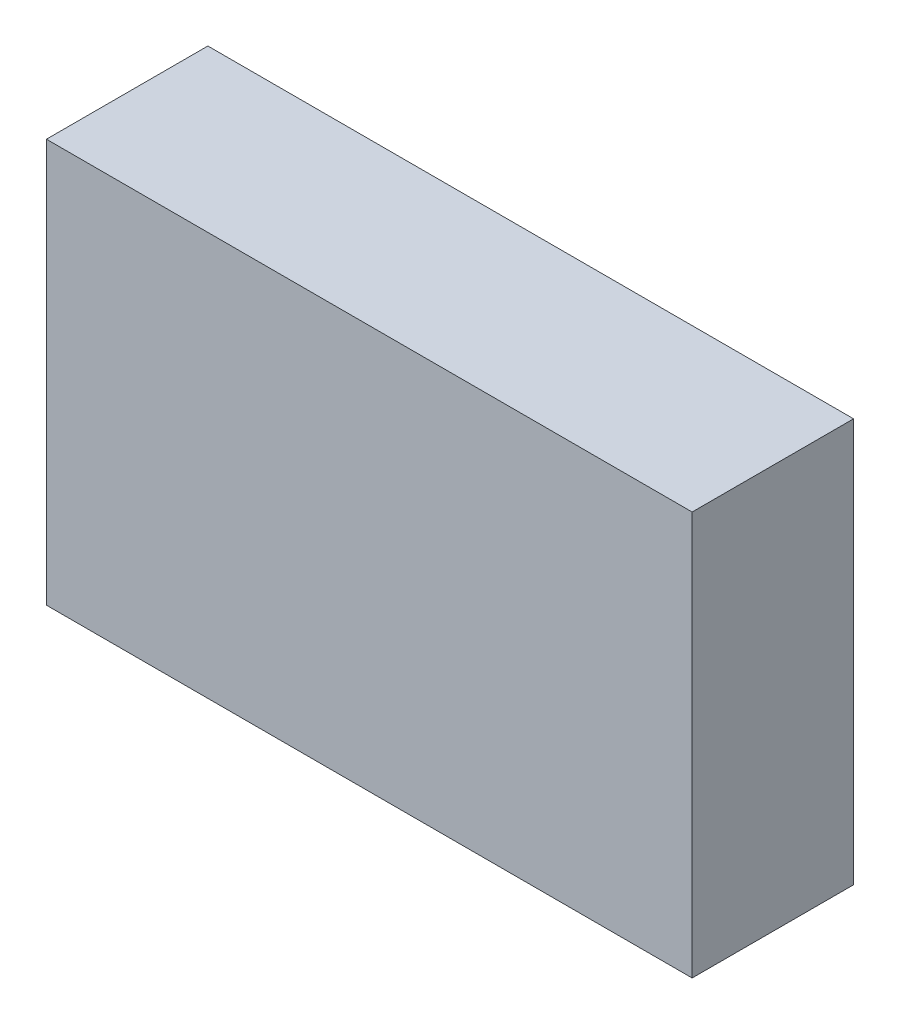
ISO-10303-21;
HEADER;
FILE_DESCRIPTION(('STEP AP214'),'2;1');
FILE_NAME('part.step','',(''),(''),'','','');
FILE_SCHEMA(('AUTOMOTIVE_DESIGN { 1 0 10303 214 1 1 1 1 }'));
ENDSEC;
DATA;
#1=APPLICATION_CONTEXT('core data for automotive mechanical design processes');
#2=APPLICATION_PROTOCOL_DEFINITION('international standard','automotive_design',2000,#1);
#3=PRODUCT_CONTEXT('',#1,'mechanical');
#4=PRODUCT('Part','Part','',(#3));
#5=PRODUCT_RELATED_PRODUCT_CATEGORY('part','',(#4));
#6=PRODUCT_DEFINITION_FORMATION('','',#4);
#7=PRODUCT_DEFINITION_CONTEXT('part definition',#1,'design');
#8=PRODUCT_DEFINITION('design','',#6,#7);
#9=PRODUCT_DEFINITION_SHAPE('','',#8);
#10=(LENGTH_UNIT() NAMED_UNIT(*) SI_UNIT(.MILLI.,.METRE.));
#11=(NAMED_UNIT(*) PLANE_ANGLE_UNIT() SI_UNIT($,.RADIAN.));
#12=(NAMED_UNIT(*) SI_UNIT($,.STERADIAN.) SOLID_ANGLE_UNIT());
#13=UNCERTAINTY_MEASURE_WITH_UNIT(LENGTH_MEASURE(1.E-05),#10,'distance_accuracy_value','');
#14=(GEOMETRIC_REPRESENTATION_CONTEXT(3) GLOBAL_UNCERTAINTY_ASSIGNED_CONTEXT((#13)) GLOBAL_UNIT_ASSIGNED_CONTEXT((#10,
#11,#12)) REPRESENTATION_CONTEXT('',''));
#15=CARTESIAN_POINT('',(0.,0.,0.));
#16=DIRECTION('',(0.,0.,1.));
#17=DIRECTION('',(1.,0.,0.));
#18=AXIS2_PLACEMENT_3D('',#15,#16,#17);
#19=CARTESIAN_POINT('',(-37.0093457943925,20.8411214953271,20.));
#20=DIRECTION('',(1.,0.,0.));
#21=DIRECTION('',(0.,1.,0.));
#22=AXIS2_PLACEMENT_3D('',#19,#20,#21);
#23=PLANE('',#22);
#24=DIRECTION('',(0.,-1.,0.));
#25=VECTOR('',#24,1.);
#26=CARTESIAN_POINT('',(-37.0093457943925,20.8411214953271,0.));
#27=LINE('',#26,#25);
#28=CARTESIAN_POINT('',(-37.0093457943925,20.8411214953271,0.));
#29=VERTEX_POINT('',#28);
#30=CARTESIAN_POINT('',(-37.0093457943925,-29.1588785046729,0.));
#31=VERTEX_POINT('',#30);
#32=EDGE_CURVE('E104',#29,#31,#27,.T.);
#33=ORIENTED_EDGE('',*,*,#32,.T.);
#34=DIRECTION('',(0.,0.,-1.));
#35=VECTOR('',#34,1.);
#36=CARTESIAN_POINT('',(-37.0093457943925,-29.1588785046729,20.));
#37=LINE('',#36,#35);
#38=CARTESIAN_POINT('',(-37.0093457943925,-29.1588785046729,20.));
#39=VERTEX_POINT('',#38);
#40=EDGE_CURVE('E11',#39,#31,#37,.T.);
#41=ORIENTED_EDGE('',*,*,#40,.F.);
#42=DIRECTION('',(0.,-1.,0.));
#43=VECTOR('',#42,1.);
#44=CARTESIAN_POINT('',(-37.0093457943925,20.8411214953271,20.));
#45=LINE('',#44,#43);
#46=CARTESIAN_POINT('',(-37.0093457943925,20.8411214953271,20.));
#47=VERTEX_POINT('',#46);
#48=EDGE_CURVE('E92',#47,#39,#45,.T.);
#49=ORIENTED_EDGE('',*,*,#48,.F.);
#50=DIRECTION('',(0.,0.,-1.));
#51=VECTOR('',#50,1.);
#52=CARTESIAN_POINT('',(-37.0093457943925,20.8411214953271,20.));
#53=LINE('',#52,#51);
#54=EDGE_CURVE('E100',#47,#29,#53,.T.);
#55=ORIENTED_EDGE('',*,*,#54,.T.);
#56=EDGE_LOOP('',(#33,#41,#49,#55));
#57=FACE_BOUND('',#56,.T.);
#58=ADVANCED_FACE('F41',(#57),#23,.F.);
#59=CARTESIAN_POINT('',(-37.0093457943925,-29.1588785046729,20.));
#60=DIRECTION('',(0.,1.,0.));
#61=DIRECTION('',(0.,0.,1.));
#62=AXIS2_PLACEMENT_3D('',#59,#60,#61);
#63=PLANE('',#62);
#64=DIRECTION('',(1.,0.,0.));
#65=VECTOR('',#64,1.);
#66=CARTESIAN_POINT('',(-37.0093457943925,-29.1588785046729,0.));
#67=LINE('',#66,#65);
#68=CARTESIAN_POINT('',(42.9906542056075,-29.1588785046729,0.));
#69=VERTEX_POINT('',#68);
#70=EDGE_CURVE('E96',#31,#69,#67,.T.);
#71=ORIENTED_EDGE('',*,*,#70,.T.);
#72=DIRECTION('',(0.,0.,-1.));
#73=VECTOR('',#72,1.);
#74=CARTESIAN_POINT('',(42.9906542056075,-29.1588785046729,20.));
#75=LINE('',#74,#73);
#76=CARTESIAN_POINT('',(42.9906542056075,-29.1588785046729,20.));
#77=VERTEX_POINT('',#76);
#78=EDGE_CURVE('E49',#77,#69,#75,.T.);
#79=ORIENTED_EDGE('',*,*,#78,.F.);
#80=DIRECTION('',(1.,0.,0.));
#81=VECTOR('',#80,1.);
#82=CARTESIAN_POINT('',(-37.0093457943925,-29.1588785046729,20.));
#83=LINE('',#82,#81);
#84=EDGE_CURVE('E87',#39,#77,#83,.T.);
#85=ORIENTED_EDGE('',*,*,#84,.F.);
#86=ORIENTED_EDGE('',*,*,#40,.T.);
#87=EDGE_LOOP('',(#71,#79,#85,#86));
#88=FACE_BOUND('',#87,.T.);
#89=ADVANCED_FACE('F95',(#88),#63,.F.);
#90=CARTESIAN_POINT('',(42.9906542056075,20.8411214953271,20.));
#91=DIRECTION('',(-1.,0.,0.));
#92=DIRECTION('',(0.,0.,1.));
#93=AXIS2_PLACEMENT_3D('',#90,#91,#92);
#94=PLANE('',#93);
#95=DIRECTION('',(0.,1.,0.));
#96=VECTOR('',#95,1.);
#97=CARTESIAN_POINT('',(42.9906542056075,20.8411214953271,0.));
#98=LINE('',#97,#96);
#99=CARTESIAN_POINT('',(42.9906542056075,20.8411214953271,0.));
#100=VERTEX_POINT('',#99);
#101=EDGE_CURVE('E74',#69,#100,#98,.T.);
#102=ORIENTED_EDGE('',*,*,#101,.T.);
#103=DIRECTION('',(0.,0.,-1.));
#104=VECTOR('',#103,1.);
#105=CARTESIAN_POINT('',(42.9906542056075,20.8411214953271,20.));
#106=LINE('',#105,#104);
#107=CARTESIAN_POINT('',(42.9906542056075,20.8411214953271,20.));
#108=VERTEX_POINT('',#107);
#109=EDGE_CURVE('E97',#108,#100,#106,.T.);
#110=ORIENTED_EDGE('',*,*,#109,.F.);
#111=DIRECTION('',(0.,1.,0.));
#112=VECTOR('',#111,1.);
#113=CARTESIAN_POINT('',(42.9906542056075,20.8411214953271,20.));
#114=LINE('',#113,#112);
#115=EDGE_CURVE('E90',#77,#108,#114,.T.);
#116=ORIENTED_EDGE('',*,*,#115,.F.);
#117=ORIENTED_EDGE('',*,*,#78,.T.);
#118=EDGE_LOOP('',(#102,#110,#116,#117));
#119=FACE_BOUND('',#118,.T.);
#120=ADVANCED_FACE('F98',(#119),#94,.F.);
#121=CARTESIAN_POINT('',(-37.0093457943925,20.8411214953271,20.));
#122=DIRECTION('',(0.,-1.,0.));
#123=DIRECTION('',(0.,0.,-1.));
#124=AXIS2_PLACEMENT_3D('',#121,#122,#123);
#125=PLANE('',#124);
#126=DIRECTION('',(-1.,0.,0.));
#127=VECTOR('',#126,1.);
#128=CARTESIAN_POINT('',(-37.0093457943925,20.8411214953271,0.));
#129=LINE('',#128,#127);
#130=EDGE_CURVE('E80',#100,#29,#129,.T.);
#131=ORIENTED_EDGE('',*,*,#130,.T.);
#132=ORIENTED_EDGE('',*,*,#54,.F.);
#133=DIRECTION('',(-1.,0.,0.));
#134=VECTOR('',#133,1.);
#135=CARTESIAN_POINT('',(-37.0093457943925,20.8411214953271,20.));
#136=LINE('',#135,#134);
#137=EDGE_CURVE('E57',#108,#47,#136,.T.);
#138=ORIENTED_EDGE('',*,*,#137,.F.);
#139=ORIENTED_EDGE('',*,*,#109,.T.);
#140=EDGE_LOOP('',(#131,#132,#138,#139));
#141=FACE_BOUND('',#140,.T.);
#142=ADVANCED_FACE('F111',(#141),#125,.F.);
#143=CARTESIAN_POINT('',(0.,0.,20.));
#144=DIRECTION('',(0.,0.,1.));
#145=DIRECTION('',(1.,0.,0.));
#146=AXIS2_PLACEMENT_3D('',#143,#144,#145);
#147=PLANE('',#146);
#148=ORIENTED_EDGE('',*,*,#48,.T.);
#149=ORIENTED_EDGE('',*,*,#84,.T.);
#150=ORIENTED_EDGE('',*,*,#115,.T.);
#151=ORIENTED_EDGE('',*,*,#137,.T.);
#152=EDGE_LOOP('',(#148,#149,#150,#151));
#153=FACE_BOUND('',#152,.T.);
#154=ADVANCED_FACE('F88',(#153),#147,.T.);
#155=CARTESIAN_POINT('',(0.,0.,0.));
#156=DIRECTION('',(0.,0.,1.));
#157=DIRECTION('',(1.,0.,0.));
#158=AXIS2_PLACEMENT_3D('',#155,#156,#157);
#159=PLANE('',#158);
#160=ORIENTED_EDGE('',*,*,#32,.F.);
#161=ORIENTED_EDGE('',*,*,#130,.F.);
#162=ORIENTED_EDGE('',*,*,#101,.F.);
#163=ORIENTED_EDGE('',*,*,#70,.F.);
#164=EDGE_LOOP('',(#160,#161,#162,#163));
#165=FACE_BOUND('',#164,.T.);
#166=ADVANCED_FACE('F114',(#165),#159,.F.);
#167=CLOSED_SHELL('',(#58,#89,#120,#142,#154,#166));
#168=MANIFOLD_SOLID_BREP('B2',#167);
#169=ADVANCED_BREP_SHAPE_REPRESENTATION('',(#18,#168),#14);
#170=SHAPE_DEFINITION_REPRESENTATION(#9,#169);
ENDSEC;
END-ISO-10303-21;
